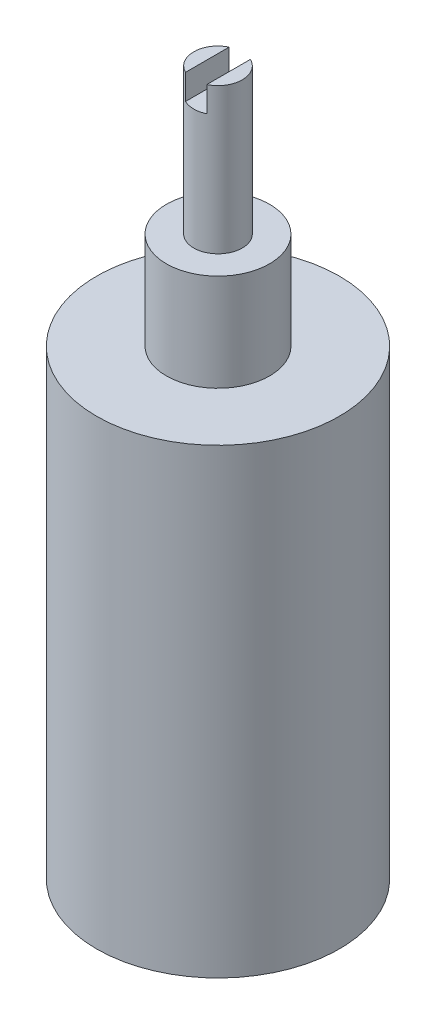
ISO-10303-21;
HEADER;
FILE_DESCRIPTION(('STEP AP214'),'2;1');
FILE_NAME('part.step','',(''),(''),'','','');
FILE_SCHEMA(('AUTOMOTIVE_DESIGN { 1 0 10303 214 1 1 1 1 }'));
ENDSEC;
DATA;
#1=APPLICATION_CONTEXT('core data for automotive mechanical design processes');
#2=APPLICATION_PROTOCOL_DEFINITION('international standard','automotive_design',2000,#1);
#3=PRODUCT_CONTEXT('',#1,'mechanical');
#4=PRODUCT('Part','Part','',(#3));
#5=PRODUCT_RELATED_PRODUCT_CATEGORY('part','',(#4));
#6=PRODUCT_DEFINITION_FORMATION('','',#4);
#7=PRODUCT_DEFINITION_CONTEXT('part definition',#1,'design');
#8=PRODUCT_DEFINITION('design','',#6,#7);
#9=PRODUCT_DEFINITION_SHAPE('','',#8);
#10=(LENGTH_UNIT() NAMED_UNIT(*) SI_UNIT(.MILLI.,.METRE.));
#11=(NAMED_UNIT(*) PLANE_ANGLE_UNIT() SI_UNIT($,.RADIAN.));
#12=(NAMED_UNIT(*) SI_UNIT($,.STERADIAN.) SOLID_ANGLE_UNIT());
#13=UNCERTAINTY_MEASURE_WITH_UNIT(LENGTH_MEASURE(1.E-05),#10,'distance_accuracy_value','');
#14=(GEOMETRIC_REPRESENTATION_CONTEXT(3) GLOBAL_UNCERTAINTY_ASSIGNED_CONTEXT((#13)) GLOBAL_UNIT_ASSIGNED_CONTEXT((#10,
#11,#12)) REPRESENTATION_CONTEXT('',''));
#15=CARTESIAN_POINT('',(0.,0.,0.));
#16=DIRECTION('',(0.,0.,1.));
#17=DIRECTION('',(1.,0.,0.));
#18=AXIS2_PLACEMENT_3D('',#15,#16,#17);
#19=CARTESIAN_POINT('',(0.,39.,0.));
#20=DIRECTION('',(0.,1.,0.));
#21=DIRECTION('',(0.,0.,1.));
#22=AXIS2_PLACEMENT_3D('',#19,#20,#21);
#23=PLANE('',#22);
#24=DIRECTION('',(0.,0.,-1.));
#25=VECTOR('',#24,1.);
#26=CARTESIAN_POINT('',(0.875030870115406,39.,0.));
#27=LINE('',#26,#25);
#28=CARTESIAN_POINT('',(0.875030870115406,39.,1.79842180156522));
#29=VERTEX_POINT('',#28);
#30=CARTESIAN_POINT('',(0.875030870115406,39.,-1.79842180156522));
#31=VERTEX_POINT('',#30);
#32=EDGE_CURVE('E60',#29,#31,#27,.T.);
#33=ORIENTED_EDGE('',*,*,#32,.F.);
#34=CARTESIAN_POINT('',(0.,39.,0.));
#35=DIRECTION('',(0.,1.,0.));
#36=DIRECTION('',(0.,0.,1.));
#37=AXIS2_PLACEMENT_3D('',#34,#35,#36);
#38=CIRCLE('',#37,2.);
#39=EDGE_CURVE('E102',#29,#31,#38,.T.);
#40=ORIENTED_EDGE('',*,*,#39,.T.);
#41=EDGE_LOOP('',(#33,#40));
#42=FACE_BOUND('',#41,.T.);
#43=ADVANCED_FACE('F37',(#42),#23,.T.);
#44=CARTESIAN_POINT('',(0.,19.,0.));
#45=DIRECTION('',(0.,-1.,0.));
#46=DIRECTION('',(0.,0.,-1.));
#47=AXIS2_PLACEMENT_3D('',#44,#45,#46);
#48=CYLINDRICAL_SURFACE('',#47,10.);
#49=CARTESIAN_POINT('',(0.,19.,0.));
#50=DIRECTION('',(0.,1.,0.));
#51=DIRECTION('',(0.,0.,1.));
#52=AXIS2_PLACEMENT_3D('',#49,#50,#51);
#53=CIRCLE('',#52,10.);
#54=CARTESIAN_POINT('',(0.,19.,10.));
#55=VERTEX_POINT('',#54);
#56=EDGE_CURVE('E116',#55,#55,#53,.T.);
#57=ORIENTED_EDGE('',*,*,#56,.F.);
#58=EDGE_LOOP('',(#57));
#59=FACE_BOUND('',#58,.T.);
#60=CARTESIAN_POINT('',(0.,-19.,0.));
#61=DIRECTION('',(0.,1.,0.));
#62=DIRECTION('',(0.,0.,1.));
#63=AXIS2_PLACEMENT_3D('',#60,#61,#62);
#64=CIRCLE('',#63,10.);
#65=CARTESIAN_POINT('',(0.,-19.,10.));
#66=VERTEX_POINT('',#65);
#67=EDGE_CURVE('E113',#66,#66,#64,.T.);
#68=ORIENTED_EDGE('',*,*,#67,.T.);
#69=EDGE_LOOP('',(#68));
#70=FACE_BOUND('',#69,.T.);
#71=ADVANCED_FACE('F39',(#59,#70),#48,.T.);
#72=CARTESIAN_POINT('',(0.,19.,0.));
#73=DIRECTION('',(0.,1.,0.));
#74=DIRECTION('',(0.,0.,1.));
#75=AXIS2_PLACEMENT_3D('',#72,#73,#74);
#76=PLANE('',#75);
#77=CARTESIAN_POINT('',(0.,19.,0.));
#78=DIRECTION('',(0.,1.,0.));
#79=DIRECTION('',(0.,0.,1.));
#80=AXIS2_PLACEMENT_3D('',#77,#78,#79);
#81=CIRCLE('',#80,4.25);
#82=CARTESIAN_POINT('',(0.,19.,4.25));
#83=VERTEX_POINT('',#82);
#84=EDGE_CURVE('E110',#83,#83,#81,.T.);
#85=ORIENTED_EDGE('',*,*,#84,.F.);
#86=EDGE_LOOP('',(#85));
#87=FACE_BOUND('',#86,.T.);
#88=ORIENTED_EDGE('',*,*,#56,.T.);
#89=EDGE_LOOP('',(#88));
#90=FACE_BOUND('',#89,.T.);
#91=ADVANCED_FACE('F131',(#87,#90),#76,.T.);
#92=CARTESIAN_POINT('',(0.,-19.,0.));
#93=DIRECTION('',(0.,1.,0.));
#94=DIRECTION('',(0.,0.,1.));
#95=AXIS2_PLACEMENT_3D('',#92,#93,#94);
#96=PLANE('',#95);
#97=ORIENTED_EDGE('',*,*,#67,.F.);
#98=EDGE_LOOP('',(#97));
#99=FACE_BOUND('',#98,.T.);
#100=ADVANCED_FACE('F152',(#99),#96,.F.);
#101=CARTESIAN_POINT('',(0.,27.,0.));
#102=DIRECTION('',(0.,-1.,0.));
#103=DIRECTION('',(0.,0.,-1.));
#104=AXIS2_PLACEMENT_3D('',#101,#102,#103);
#105=CYLINDRICAL_SURFACE('',#104,4.25);
#106=CARTESIAN_POINT('',(0.,27.,0.));
#107=DIRECTION('',(0.,1.,0.));
#108=DIRECTION('',(0.,0.,1.));
#109=AXIS2_PLACEMENT_3D('',#106,#107,#108);
#110=CIRCLE('',#109,4.25);
#111=CARTESIAN_POINT('',(0.,27.,4.25));
#112=VERTEX_POINT('',#111);
#113=EDGE_CURVE('E105',#112,#112,#110,.T.);
#114=ORIENTED_EDGE('',*,*,#113,.F.);
#115=EDGE_LOOP('',(#114));
#116=FACE_BOUND('',#115,.T.);
#117=ORIENTED_EDGE('',*,*,#84,.T.);
#118=EDGE_LOOP('',(#117));
#119=FACE_BOUND('',#118,.T.);
#120=ADVANCED_FACE('F146',(#116,#119),#105,.T.);
#121=CARTESIAN_POINT('',(0.,27.,0.));
#122=DIRECTION('',(0.,1.,0.));
#123=DIRECTION('',(0.,0.,1.));
#124=AXIS2_PLACEMENT_3D('',#121,#122,#123);
#125=PLANE('',#124);
#126=CARTESIAN_POINT('',(0.,27.,0.));
#127=DIRECTION('',(0.,1.,0.));
#128=DIRECTION('',(0.,0.,1.));
#129=AXIS2_PLACEMENT_3D('',#126,#127,#128);
#130=CIRCLE('',#129,2.);
#131=CARTESIAN_POINT('',(0.,27.,2.));
#132=VERTEX_POINT('',#131);
#133=EDGE_CURVE('E106',#132,#132,#130,.T.);
#134=ORIENTED_EDGE('',*,*,#133,.F.);
#135=EDGE_LOOP('',(#134));
#136=FACE_BOUND('',#135,.T.);
#137=ORIENTED_EDGE('',*,*,#113,.T.);
#138=EDGE_LOOP('',(#137));
#139=FACE_BOUND('',#138,.T.);
#140=ADVANCED_FACE('F142',(#136,#139),#125,.T.);
#141=CARTESIAN_POINT('',(0.,39.,0.));
#142=DIRECTION('',(0.,-1.,0.));
#143=DIRECTION('',(0.,0.,-1.));
#144=AXIS2_PLACEMENT_3D('',#141,#142,#143);
#145=CYLINDRICAL_SURFACE('',#144,2.);
#146=CARTESIAN_POINT('',(0.,36.9178621188925,0.));
#147=DIRECTION('',(0.,-1.,0.));
#148=DIRECTION('',(0.,0.,-1.));
#149=AXIS2_PLACEMENT_3D('',#146,#147,#148);
#150=CIRCLE('',#149,2.);
#151=CARTESIAN_POINT('',(-0.875030870115406,36.9178621188925,-1.79842180156521));
#152=VERTEX_POINT('',#151);
#153=CARTESIAN_POINT('',(0.875030870115406,36.9178621188925,-1.79842180156522));
#154=VERTEX_POINT('',#153);
#155=EDGE_CURVE('E11',#152,#154,#150,.T.);
#156=ORIENTED_EDGE('',*,*,#155,.T.);
#157=DIRECTION('',(0.,-1.,0.));
#158=VECTOR('',#157,1.);
#159=CARTESIAN_POINT('',(0.875030870115406,39.,-1.79842180156522));
#160=LINE('',#159,#158);
#161=EDGE_CURVE('E94',#154,#31,#160,.F.);
#162=ORIENTED_EDGE('',*,*,#161,.T.);
#163=ORIENTED_EDGE('',*,*,#39,.F.);
#164=DIRECTION('',(0.,-1.,0.));
#165=VECTOR('',#164,1.);
#166=CARTESIAN_POINT('',(0.875030870115406,39.,1.79842180156522));
#167=LINE('',#166,#165);
#168=CARTESIAN_POINT('',(0.875030870115406,36.9178621188925,1.79842180156522));
#169=VERTEX_POINT('',#168);
#170=EDGE_CURVE('E96',#29,#169,#167,.T.);
#171=ORIENTED_EDGE('',*,*,#170,.T.);
#172=CARTESIAN_POINT('',(-0.875030870115406,36.9178621188925,1.79842180156521));
#173=VERTEX_POINT('',#172);
#174=EDGE_CURVE('E41',#169,#173,#150,.T.);
#175=ORIENTED_EDGE('',*,*,#174,.T.);
#176=DIRECTION('',(0.,-1.,0.));
#177=VECTOR('',#176,1.);
#178=CARTESIAN_POINT('',(-0.875030870115406,39.,1.79842180156522));
#179=LINE('',#178,#177);
#180=CARTESIAN_POINT('',(-0.875030870115406,39.,1.79842180156522));
#181=VERTEX_POINT('',#180);
#182=EDGE_CURVE('E87',#173,#181,#179,.F.);
#183=ORIENTED_EDGE('',*,*,#182,.T.);
#184=CARTESIAN_POINT('',(-0.875030870115406,39.,-1.79842180156522));
#185=VERTEX_POINT('',#184);
#186=EDGE_CURVE('E93',#185,#181,#38,.T.);
#187=ORIENTED_EDGE('',*,*,#186,.F.);
#188=DIRECTION('',(0.,-1.,0.));
#189=VECTOR('',#188,1.);
#190=CARTESIAN_POINT('',(-0.875030870115406,39.,-1.79842180156522));
#191=LINE('',#190,#189);
#192=EDGE_CURVE('E52',#185,#152,#191,.T.);
#193=ORIENTED_EDGE('',*,*,#192,.T.);
#194=EDGE_LOOP('',(#156,#162,#163,#171,#175,#183,#187,#193));
#195=FACE_BOUND('',#194,.T.);
#196=ORIENTED_EDGE('',*,*,#133,.T.);
#197=EDGE_LOOP('',(#196));
#198=FACE_BOUND('',#197,.T.);
#199=ADVANCED_FACE('F90',(#195,#198),#145,.T.);
#200=DIRECTION('',(0.,0.,1.));
#201=VECTOR('',#200,1.);
#202=CARTESIAN_POINT('',(-0.875030870115406,39.,0.));
#203=LINE('',#202,#201);
#204=EDGE_CURVE('E109',#185,#181,#203,.T.);
#205=ORIENTED_EDGE('',*,*,#204,.F.);
#206=ORIENTED_EDGE('',*,*,#186,.T.);
#207=EDGE_LOOP('',(#205,#206));
#208=FACE_BOUND('',#207,.T.);
#209=ADVANCED_FACE('F127',(#208),#23,.T.);
#210=CARTESIAN_POINT('',(-0.875030870115406,36.9178621188925,-10.));
#211=DIRECTION('',(0.,-1.,0.));
#212=DIRECTION('',(0.,0.,-1.));
#213=AXIS2_PLACEMENT_3D('',#210,#211,#212);
#214=PLANE('',#213);
#215=DIRECTION('',(0.,0.,1.));
#216=VECTOR('',#215,1.);
#217=CARTESIAN_POINT('',(0.875030870115406,36.9178621188925,-10.));
#218=LINE('',#217,#216);
#219=EDGE_CURVE('E83',#154,#169,#218,.T.);
#220=ORIENTED_EDGE('',*,*,#219,.F.);
#221=ORIENTED_EDGE('',*,*,#155,.F.);
#222=DIRECTION('',(0.,0.,1.));
#223=VECTOR('',#222,1.);
#224=CARTESIAN_POINT('',(-0.875030870115406,36.9178621188925,-10.));
#225=LINE('',#224,#223);
#226=EDGE_CURVE('E80',#152,#173,#225,.T.);
#227=ORIENTED_EDGE('',*,*,#226,.T.);
#228=ORIENTED_EDGE('',*,*,#174,.F.);
#229=EDGE_LOOP('',(#220,#221,#227,#228));
#230=FACE_BOUND('',#229,.T.);
#231=ADVANCED_FACE('F79',(#230),#214,.F.);
#232=CARTESIAN_POINT('',(0.875030870115406,41.0821378811075,-10.));
#233=DIRECTION('',(1.,0.,0.));
#234=DIRECTION('',(0.,0.,-1.));
#235=AXIS2_PLACEMENT_3D('',#232,#233,#234);
#236=PLANE('',#235);
#237=ORIENTED_EDGE('',*,*,#32,.T.);
#238=ORIENTED_EDGE('',*,*,#161,.F.);
#239=ORIENTED_EDGE('',*,*,#219,.T.);
#240=ORIENTED_EDGE('',*,*,#170,.F.);
#241=EDGE_LOOP('',(#237,#238,#239,#240));
#242=FACE_BOUND('',#241,.T.);
#243=ADVANCED_FACE('F122',(#242),#236,.F.);
#244=CARTESIAN_POINT('',(-0.875030870115406,41.0821378811075,-10.));
#245=DIRECTION('',(-1.,0.,0.));
#246=DIRECTION('',(0.,0.,1.));
#247=AXIS2_PLACEMENT_3D('',#244,#245,#246);
#248=PLANE('',#247);
#249=ORIENTED_EDGE('',*,*,#204,.T.);
#250=ORIENTED_EDGE('',*,*,#182,.F.);
#251=ORIENTED_EDGE('',*,*,#226,.F.);
#252=ORIENTED_EDGE('',*,*,#192,.F.);
#253=EDGE_LOOP('',(#249,#250,#251,#252));
#254=FACE_BOUND('',#253,.T.);
#255=ADVANCED_FACE('F85',(#254),#248,.F.);
#256=CLOSED_SHELL('',(#43,#71,#91,#100,#120,#140,#199,#209,#231,#243,#255));
#257=MANIFOLD_SOLID_BREP('B2',#256);
#258=ADVANCED_BREP_SHAPE_REPRESENTATION('',(#18,#257),#14);
#259=SHAPE_DEFINITION_REPRESENTATION(#9,#258);
ENDSEC;
END-ISO-10303-21;
